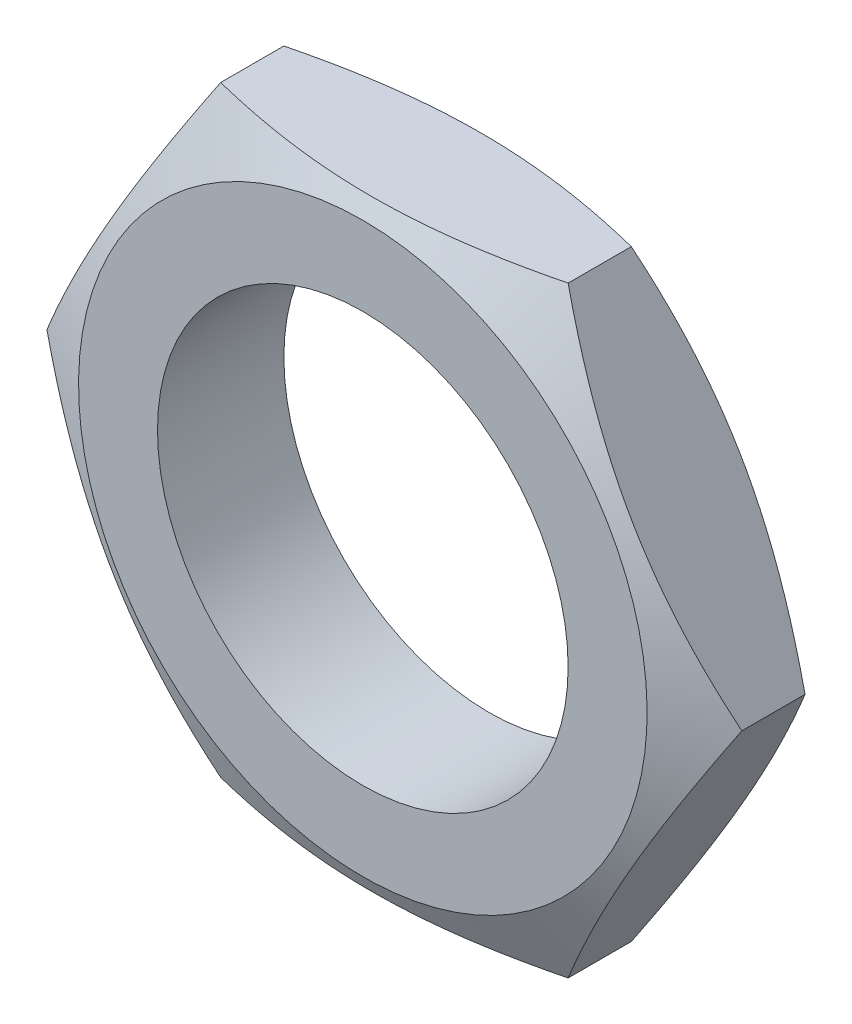
ISO-10303-21;
HEADER;
FILE_DESCRIPTION(('STEP AP214'),'2;1');
FILE_NAME('part.step','',(''),(''),'','','');
FILE_SCHEMA(('AUTOMOTIVE_DESIGN { 1 0 10303 214 1 1 1 1 }'));
ENDSEC;
DATA;
#1=APPLICATION_CONTEXT('core data for automotive mechanical design processes');
#2=APPLICATION_PROTOCOL_DEFINITION('international standard','automotive_design',2000,#1);
#3=PRODUCT_CONTEXT('',#1,'mechanical');
#4=PRODUCT('Part','Part','',(#3));
#5=PRODUCT_RELATED_PRODUCT_CATEGORY('part','',(#4));
#6=PRODUCT_DEFINITION_FORMATION('','',#4);
#7=PRODUCT_DEFINITION_CONTEXT('part definition',#1,'design');
#8=PRODUCT_DEFINITION('design','',#6,#7);
#9=PRODUCT_DEFINITION_SHAPE('','',#8);
#10=(LENGTH_UNIT() NAMED_UNIT(*) SI_UNIT(.MILLI.,.METRE.));
#11=(NAMED_UNIT(*) PLANE_ANGLE_UNIT() SI_UNIT($,.RADIAN.));
#12=(NAMED_UNIT(*) SI_UNIT($,.STERADIAN.) SOLID_ANGLE_UNIT());
#13=UNCERTAINTY_MEASURE_WITH_UNIT(LENGTH_MEASURE(1.E-05),#10,'distance_accuracy_value','');
#14=(GEOMETRIC_REPRESENTATION_CONTEXT(3) GLOBAL_UNCERTAINTY_ASSIGNED_CONTEXT((#13)) GLOBAL_UNIT_ASSIGNED_CONTEXT((#10,
#11,#12)) REPRESENTATION_CONTEXT('',''));
#15=CARTESIAN_POINT('',(0.,0.,0.));
#16=DIRECTION('',(0.,0.,1.));
#17=DIRECTION('',(1.,0.,0.));
#18=AXIS2_PLACEMENT_3D('',#15,#16,#17);
#19=CARTESIAN_POINT('',(5.5,0.,0.));
#20=DIRECTION('',(0.866025403784329,-0.50000000000019,0.));
#21=DIRECTION('',(0.50000000000019,0.866025403784329,0.));
#22=AXIS2_PLACEMENT_3D('',#19,#20,#21);
#23=PLANE('',#22);
#24=CARTESIAN_POINT('',(2.74999998059165,-4.76313975442826,1.49999998955182));
#25=CARTESIAN_POINT('',(2.82750720895632,-4.62889329694687,1.53875074037462));
#26=CARTESIAN_POINT('',(2.90531639391744,-4.49412383529876,1.57520168182588));
#27=CARTESIAN_POINT('',(3.06155449277679,-4.22351150999653,1.64273635788375));
#28=CARTESIAN_POINT('',(3.13998370419947,-4.08766813101495,1.67381732871496));
#29=CARTESIAN_POINT('',(3.29751454712741,-3.81481670730475,1.72984451622244));
#30=CARTESIAN_POINT('',(3.37661700193326,-3.67780723657767,1.75478158665256));
#31=CARTESIAN_POINT('',(3.53528348723896,-3.40298882256994,1.79769273905488));
#32=CARTESIAN_POINT('',(3.61484743578261,-3.26518002124162,1.81566802112473));
#33=CARTESIAN_POINT('',(3.77250869375858,-2.99210271204215,1.84370689634938));
#34=CARTESIAN_POINT('',(3.85059836169878,-2.85684743962362,1.85394060943592));
#35=CARTESIAN_POINT('',(4.00694020917695,-2.58605541644237,1.86677848579471));
#36=CARTESIAN_POINT('',(4.08519239654035,-2.45051865212563,1.86938227273784));
#37=CARTESIAN_POINT('',(4.24158076658097,-2.17964604950253,1.86685932607153));
#38=CARTESIAN_POINT('',(4.31971698340526,-2.04431015205171,1.8617409185904));
#39=CARTESIAN_POINT('',(4.47576670243946,-1.77402411017777,1.84398620167749));
#40=CARTESIAN_POINT('',(4.55368022306874,-1.63907393385136,1.83135053321334));
#41=CARTESIAN_POINT('',(4.70423744205068,-1.3783011811285,1.80003821329454));
#42=CARTESIAN_POINT('',(4.77690386486142,-1.25243924481608,1.78179235445715));
#43=CARTESIAN_POINT('',(4.92182855252511,-1.00142232251164,1.73962093699504));
#44=CARTESIAN_POINT('',(4.99408677303879,-0.876267413317495,1.71569477306956));
#45=CARTESIAN_POINT('',(5.13893428940125,-0.625384155627685,1.66246300904158));
#46=CARTESIAN_POINT('',(5.21151829478282,-0.499664970490019,1.63310040795472));
#47=CARTESIAN_POINT('',(5.3561537935932,-0.249148937972488,1.56981511919453));
#48=CARTESIAN_POINT('',(5.42820551936946,-0.12435168815506,1.53589456249241));
#49=CARTESIAN_POINT('',(5.49999991704114,-1.43688962935958E-07,1.50000004073438));
#50=B_SPLINE_CURVE_WITH_KNOTS('',3,(#24,#25,#26,#27,#28,#29,#30,#31,#32,#33,#34,#35,#36,#37,#38,
#39,#40,#41,#42,#43,#44,#45,#46,#47,#48,#49),.UNSPECIFIED.,.F.,.F.,(4,2,2,2,2,2,2,2,2,2,2,2,4),
(0.,0.479378142592037,0.959002277620051,1.43933615856273,1.91958720096182,2.38895095487023,
2.85833785871055,3.32721902760548,3.79606022255459,4.23536075408386,4.67470811908086,
5.11895373860353,5.56299237892725),.UNSPECIFIED.);
#51=CARTESIAN_POINT('',(2.74999997898633,-4.763139720814,1.50000000450855));
#52=VERTEX_POINT('',#51);
#53=CARTESIAN_POINT('',(5.49999993221398,-2.35344048637145E-08,1.50000003314796));
#54=VERTEX_POINT('',#53);
#55=EDGE_CURVE('E187',#52,#54,#50,.T.);
#56=ORIENTED_EDGE('',*,*,#55,.F.);
#57=DIRECTION('',(0.,0.,-1.));
#58=VECTOR('',#57,1.);
#59=CARTESIAN_POINT('',(2.750000041603,-4.763139720814,0.));
#60=LINE('',#59,#58);
#61=CARTESIAN_POINT('',(2.75000002365616,-4.76313971586859,0.500000004583533));
#62=VERTEX_POINT('',#61);
#63=EDGE_CURVE('E106',#62,#52,#60,.F.);
#64=ORIENTED_EDGE('',*,*,#63,.F.);
#65=CARTESIAN_POINT('',(5.49999993094799,-3.30845369369087E-08,0.500000014649597));
#66=CARTESIAN_POINT('',(5.42249273002794,-0.134246498468859,0.461249247560524));
#67=CARTESIAN_POINT('',(5.344683557131,-0.269015961969993,0.424798300413727));
#68=CARTESIAN_POINT('',(5.18844546893168,-0.539628285472494,0.357263622273518));
#69=CARTESIAN_POINT('',(5.11001625609849,-0.675471660797522,0.326182655054674));
#70=CARTESIAN_POINT('',(4.95248541414733,-0.948323078343564,0.270155472205021));
#71=CARTESIAN_POINT('',(4.87338296173508,-1.08533254656352,0.245218402806533));
#72=CARTESIAN_POINT('',(4.71471648023915,-1.36015095517064,0.202307252934864));
#73=CARTESIAN_POINT('',(4.63515253311164,-1.49795975360592,0.184331972366961));
#74=CARTESIAN_POINT('',(4.47749127831852,-1.77103705697854,0.156293099696337));
#75=CARTESIAN_POINT('',(4.39940161213869,-1.90629232646164,0.146059387663566));
#76=CARTESIAN_POINT('',(4.24305976815914,-2.17708434366626,0.133221513147316));
#77=CARTESIAN_POINT('',(4.16480758253403,-2.31262110494174,0.130617726991038));
#78=CARTESIAN_POINT('',(4.00841921595162,-2.58349370155279,0.133140674867172));
#79=CARTESIAN_POINT('',(3.93028300084722,-2.71882959603281,0.138259082776479));
#80=CARTESIAN_POINT('',(3.77423328524083,-2.98911563197557,0.156013800200948));
#81=CARTESIAN_POINT('',(3.69631976631948,-3.12406580534156,0.168649468749318));
#82=CARTESIAN_POINT('',(3.54576254337759,-3.38483856492177,0.199961790023261));
#83=CARTESIAN_POINT('',(3.47309611493224,-3.51070051099414,0.218207650769129));
#84=CARTESIAN_POINT('',(3.32817141608381,-3.76171745267151,0.260379072865122));
#85=CARTESIAN_POINT('',(3.25591319001994,-3.88687237147872,0.284305239515238));
#86=CARTESIAN_POINT('',(3.11106566246679,-4.13775564855126,0.3375370097382));
#87=CARTESIAN_POINT('',(3.03848165144636,-4.26347484345576,0.366899614310797));
#88=CARTESIAN_POINT('',(2.89384614143332,-4.51399089537691,0.430184910602372));
#89=CARTESIAN_POINT('',(2.82179441009331,-4.63878815483107,0.464105471350446));
#90=CARTESIAN_POINT('',(2.75000000689699,-4.76313970886606,0.49999999736156));
#91=B_SPLINE_CURVE_WITH_KNOTS('',3,(#65,#66,#67,#68,#69,#70,#71,#72,#73,#74,#75,#76,#77,#78,#79,
#80,#81,#82,#83,#84,#85,#86,#87,#88,#89,#90),.UNSPECIFIED.,.F.,.F.,(4,2,2,2,2,2,2,2,2,2,2,2,4),
(0.,0.479378133540439,0.959002259014858,1.43933612961816,1.91958716188759,2.38895090537266,
2.85833779867252,3.32721895733129,3.79606014209499,4.23536070785375,4.67470810701921,
5.11895376176314,5.56299243734623),.UNSPECIFIED.);
#92=CARTESIAN_POINT('',(5.49999977310214,2.95322379273276E-09,0.499999887425601));
#93=VERTEX_POINT('',#92);
#94=EDGE_CURVE('E181',#93,#62,#91,.T.);
#95=ORIENTED_EDGE('',*,*,#94,.F.);
#96=DIRECTION('',(0.,0.,1.));
#97=VECTOR('',#96,1.);
#98=CARTESIAN_POINT('',(5.49999994580216,9.38754195906055E-08,0.));
#99=LINE('',#98,#97);
#100=EDGE_CURVE('E90',#54,#93,#99,.F.);
#101=ORIENTED_EDGE('',*,*,#100,.F.);
#102=EDGE_LOOP('',(#56,#64,#95,#101));
#103=FACE_BOUND('',#102,.T.);
#104=ADVANCED_FACE('F17',(#103),#23,.T.);
#105=CARTESIAN_POINT('',(2.75,4.763139720814,0.));
#106=DIRECTION('',(0.866025403784329,0.50000000000019,0.));
#107=DIRECTION('',(-0.50000000000019,0.866025403784329,0.));
#108=AXIS2_PLACEMENT_3D('',#105,#106,#107);
#109=PLANE('',#108);
#110=CARTESIAN_POINT('',(5.49999990740493,2.84497346673083E-08,1.49999997180047));
#111=CARTESIAN_POINT('',(5.42249272039935,0.134246498834246,1.53875074815011));
#112=CARTESIAN_POINT('',(5.34468355334028,0.269015964165199,1.57520169901391));
#113=CARTESIAN_POINT('',(5.18844546973658,0.539628288455109,1.64273637969795));
#114=CARTESIAN_POINT('',(5.11001625565781,0.675471662735756,1.67381734574399));
#115=CARTESIAN_POINT('',(4.95248541318418,0.948323078839099,1.7298445275809));
#116=CARTESIAN_POINT('',(4.87338296149828,1.08533254666116,1.75478159714575));
#117=CARTESIAN_POINT('',(4.71471648092729,1.36015095429518,1.79769274705994));
#118=CARTESIAN_POINT('',(4.63515253399834,1.49795975215547,1.81566802750249));
#119=CARTESIAN_POINT('',(4.47749127978081,1.77103705436631,1.84370690007331));
#120=CARTESIAN_POINT('',(4.39940161397504,1.90629232326116,1.85394061213215));
#121=CARTESIAN_POINT('',(4.2430597707178,2.17708433925837,1.86677848674587));
#122=CARTESIAN_POINT('',(4.16480758544095,2.31262109991465,1.86938227297453));
#123=CARTESIAN_POINT('',(4.00841921954027,2.58349369533323,1.86685932531982));
#124=CARTESIAN_POINT('',(3.93028300476934,2.71882958923995,1.86174091755741));
#125=CARTESIAN_POINT('',(3.77423328981852,2.98911562405034,1.84398620048343));
#126=CARTESIAN_POINT('',(3.69631977121929,3.12406579685725,1.83135053213832));
#127=CARTESIAN_POINT('',(3.54576255164375,3.38483855060596,1.80003821187679));
#128=CARTESIAN_POINT('',(3.47309612623062,3.51070049142666,1.7817923521709));
#129=CARTESIAN_POINT('',(3.32817143341531,3.76171742265456,1.73962093259767));
#130=CARTESIAN_POINT('',(3.25591321035231,3.88687233626405,1.71569476743109));
#131=CARTESIAN_POINT('',(3.11106568880828,4.13775560292844,1.6624630005627));
#132=CARTESIAN_POINT('',(3.03848168079549,4.26347479262355,1.6331003978665));
#133=CARTESIAN_POINT('',(2.89384617673973,4.51399083422642,1.56981510561706));
#134=CARTESIAN_POINT('',(2.82179444834946,4.63878808857151,1.53589454703375));
#135=CARTESIAN_POINT('',(2.7500000480821,4.76313963753335,1.50000002329619));
#136=B_SPLINE_CURVE_WITH_KNOTS('',3,(#110,#111,#112,#113,#114,#115,#116,#117,#118,#119,#120,
#121,#122,#123,#124,#125,#126,#127,#128,#129,#130,#131,#132,#133,#134,#135),.UNSPECIFIED.,.F.,
.F.,(4,2,2,2,2,2,2,2,2,2,2,2,4),(0.,0.479378132177732,0.959002256032765,1.43933612468066,
1.91958715510268,2.38895089652017,2.85833778769214,3.32721894435149,3.79606012713717,
4.23536067447197,4.6747080551579,5.11895369110536,5.56299234798144),.UNSPECIFIED.);
#137=CARTESIAN_POINT('',(2.7500000298846,4.7631396790307,1.50000000987668));
#138=VERTEX_POINT('',#137);
#139=EDGE_CURVE('E192',#54,#138,#136,.T.);
#140=ORIENTED_EDGE('',*,*,#139,.F.);
#141=ORIENTED_EDGE('',*,*,#100,.T.);
#142=CARTESIAN_POINT('',(2.75000002969539,4.76313964696146,0.49999998870297));
#143=CARTESIAN_POINT('',(2.82750726240892,4.62889319631304,0.461249235116208));
#144=CARTESIAN_POINT('',(2.90531644836219,4.49412373884122,0.424798293649872));
#145=CARTESIAN_POINT('',(3.06155454620447,4.22351141961863,0.357263619964566));
#146=CARTESIAN_POINT('',(3.13998375561624,4.08766804253951,0.326182651520666));
#147=CARTESIAN_POINT('',(3.29751459522609,3.81481662341751,0.270155468090289));
#148=CARTESIAN_POINT('',(3.37661704872552,3.67780715537785,0.245218399344767));
#149=CARTESIAN_POINT('',(3.53528353117538,3.40298874662705,0.202307250341607));
#150=CARTESIAN_POINT('',(3.6148474781697,3.26517994786817,0.184331969987125));
#151=CARTESIAN_POINT('',(3.77250873311986,2.99210264382819,0.156293097896189));
#152=CARTESIAN_POINT('',(3.85059839958329,2.85684737399695,0.146059386235723));
#153=CARTESIAN_POINT('',(4.00694024405337,2.58605535604742,0.133221512481052));
#154=CARTESIAN_POINT('',(4.08519242988544,2.45051859437514,0.130617726715453));
#155=CARTESIAN_POINT('',(4.24158079686456,2.17964599704893,0.133140675421906));
#156=CARTESIAN_POINT('',(4.31971701215871,2.0443101022505,0.138259083767985));
#157=CARTESIAN_POINT('',(4.47576672812235,1.77402406569647,0.156013802080627));
#158=CARTESIAN_POINT('',(4.55368024721121,1.63907389203758,0.168649471079848));
#159=CARTESIAN_POINT('',(4.7042374670579,1.37830113781653,0.199961792518025));
#160=CARTESIAN_POINT('',(4.77690389225638,1.25243919736857,0.218207652686952));
#161=CARTESIAN_POINT('',(4.92182858465376,1.00142226686524,0.260379073114698));
#162=CARTESIAN_POINT('',(4.99408680751341,0.876267353607718,0.28430523867401));
#163=CARTESIAN_POINT('',(5.13893432858825,0.625384087755782,0.337537006237026));
#164=CARTESIAN_POINT('',(5.2115183363356,0.499664898520474,0.366899609230059));
#165=CARTESIAN_POINT('',(5.35615383984345,0.249148857866715,0.430184901988391));
#166=CARTESIAN_POINT('',(5.42820556795139,0.124351604010701,0.464105460782557));
#167=CARTESIAN_POINT('',(5.49999996793887,5.55335039963118E-08,0.499999984695439));
#168=B_SPLINE_CURVE_WITH_KNOTS('',3,(#142,#143,#144,#145,#146,#147,#148,#149,#150,#151,#152,
#153,#154,#155,#156,#157,#158,#159,#160,#161,#162,#163,#164,#165,#166,#167),.UNSPECIFIED.,.F.,
.F.,(4,2,2,2,2,2,2,2,2,2,2,2,4),(0.,0.479378133482542,0.959002259257795,1.43933613061397,
1.91958716348448,2.3889509082076,2.85833780283198,3.32721896264275,3.79606014852415,
4.2353606947543,4.67470807443204,5.11895370899716,5.56299236437162),.UNSPECIFIED.);
#169=CARTESIAN_POINT('',(2.75000000876441,4.763139720814,0.500000002916928));
#170=VERTEX_POINT('',#169);
#171=EDGE_CURVE('E21',#170,#93,#168,.T.);
#172=ORIENTED_EDGE('',*,*,#171,.F.);
#173=DIRECTION('',(0.,0.,1.));
#174=VECTOR('',#173,1.);
#175=CARTESIAN_POINT('',(2.750000011522,4.763139720814,0.));
#176=LINE('',#175,#174);
#177=EDGE_CURVE('E79',#138,#170,#176,.F.);
#178=ORIENTED_EDGE('',*,*,#177,.F.);
#179=EDGE_LOOP('',(#140,#141,#172,#178));
#180=FACE_BOUND('',#179,.T.);
#181=ADVANCED_FACE('F103',(#180),#109,.T.);
#182=CARTESIAN_POINT('',(-2.75,4.763139720814,0.));
#183=DIRECTION('',(0.,1.,0.));
#184=DIRECTION('',(0.,0.,1.));
#185=AXIS2_PLACEMENT_3D('',#182,#183,#184);
#186=PLANE('',#185);
#187=CARTESIAN_POINT('',(2.75000004666141,4.763139720814,1.49999998758978));
#188=CARTESIAN_POINT('',(2.52342892769615,4.76313972175959,1.55665457757312));
#189=CARTESIAN_POINT('',(2.2954867106483,4.76313972128717,1.60838808374892));
#190=CARTESIAN_POINT('',(1.83681715398184,4.76313972034008,1.69964852347283));
#191=CARTESIAN_POINT('',(1.6060859734503,4.76313971986542,1.73915598482013));
#192=CARTESIAN_POINT('',(1.14659683709032,4.76313972174588,1.80283925060461));
#193=CARTESIAN_POINT('',(0.917875671249006,4.76313972405134,1.82727276192893));
#194=CARTESIAN_POINT('',(0.459435732803817,4.76313971757916,1.86006200573323));
#195=CARTESIAN_POINT('',(0.229717866401829,4.76313970881009,1.86843013255323));
#196=CARTESIAN_POINT('',(-0.229717865930029,4.76313970881009,1.86843013255337));
#197=CARTESIAN_POINT('',(-0.4594357318599,4.76313971757916,1.86006200576789));
#198=CARTESIAN_POINT('',(-0.917875669366806,4.76313972405134,1.82727276209647));
#199=CARTESIAN_POINT('',(-1.14659683474196,4.76313972174588,1.80283925087062));
#200=CARTESIAN_POINT('',(-1.60608597016373,4.76313971986542,1.73915598533625));
#201=CARTESIAN_POINT('',(-1.83681715022349,4.76313972034008,1.69964852414204));
#202=CARTESIAN_POINT('',(-2.29548670596061,4.76313972128717,1.60838808476027));
#203=CARTESIAN_POINT('',(-2.52342892255087,4.76313972175959,1.55665457877335));
#204=CARTESIAN_POINT('',(-2.75000004106403,4.763139720814,1.49999998898913));
#205=B_SPLINE_CURVE_WITH_KNOTS('',3,(#187,#188,#189,#190,#191,#192,#193,#194,#195,#196,#197,
#198,#199,#200,#201,#202,#203,#204),.UNSPECIFIED.,.F.,.F.,(4,2,2,2,2,2,2,2,4),(0.,
0.700792750131162,1.40269596315295,2.09224026422371,2.78125237221931,3.4702644787998,
4.15980877845142,4.86171199000222,5.56250473867125),.UNSPECIFIED.);
#206=CARTESIAN_POINT('',(-2.75000001962436,4.7631397223851,1.49999999366874));
#207=VERTEX_POINT('',#206);
#208=EDGE_CURVE('E84',#138,#207,#205,.T.);
#209=ORIENTED_EDGE('',*,*,#208,.F.);
#210=ORIENTED_EDGE('',*,*,#177,.T.);
#211=CARTESIAN_POINT('',(-2.75000006030562,4.76313966130576,0.500000056566638));
#212=CARTESIAN_POINT('',(-2.59498560953767,4.76313969943746,0.461249280789425));
#213=CARTESIAN_POINT('',(-2.43936724218275,4.76313971508455,0.424798328908528));
#214=CARTESIAN_POINT('',(-2.12689104681995,4.76313972654639,0.357263644814905));
#215=CARTESIAN_POINT('',(-1.97003262376324,4.76313972235095,0.32618267637664));
#216=CARTESIAN_POINT('',(-1.65497093856631,4.76313971927478,0.27015549018335));
#217=CARTESIAN_POINT('',(-1.49676602982806,4.76313972040191,0.245218418658231));
#218=CARTESIAN_POINT('',(-1.17943306064616,4.76313972122601,0.202307264872255));
#219=CARTESIAN_POINT('',(-1.02030516411441,4.76313972092322,0.184331982517688));
#220=CARTESIAN_POINT('',(-0.704982649718567,4.76313972070725,0.156293106428864));
#221=CARTESIAN_POINT('',(-0.548803314839606,4.7631397207854,0.146059392751045));
#222=CARTESIAN_POINT('',(-0.236119621898184,4.7631397208426,0.133221515162552));
#223=CARTESIAN_POINT('',(-0.0796152481849835,4.76313972082166,0.130617727578367));
#224=CARTESIAN_POINT('',(0.233161490009973,4.76313972080635,0.133140672852487));
#225=CARTESIAN_POINT('',(0.389433922785794,4.76313972081195,0.138259079587925));
#226=CARTESIAN_POINT('',(0.701533359168725,4.76313972081605,0.156013794961259));
#227=CARTESIAN_POINT('',(0.857360399614524,4.76313972081453,0.168649462632588));
#228=CARTESIAN_POINT('',(1.15847485492737,4.7631397208135,0.199961782959037));
#229=CARTESIAN_POINT('',(1.3038077186234,4.76313972081387,0.218207643801741));
#230=CARTESIAN_POINT('',(1.59365712986701,4.76313972081413,0.260379066674078));
#231=CARTESIAN_POINT('',(1.73817358873615,4.76313972081404,0.284305234003716));
#232=CARTESIAN_POINT('',(2.02786865746347,4.76313972081396,0.337537006126594));
#233=CARTESIAN_POINT('',(2.17303668638206,4.76313972081398,0.366899611930478));
#234=CARTESIAN_POINT('',(2.46230772006374,4.76313972081402,0.430184911120166));
#235=CARTESIAN_POINT('',(2.60641118952173,4.76313972081404,0.464105473534768));
#236=CARTESIAN_POINT('',(2.75000000264251,4.763139720814,0.500000001386451));
#237=B_SPLINE_CURVE_WITH_KNOTS('',3,(#211,#212,#213,#214,#215,#216,#217,#218,#219,#220,#221,
#222,#223,#224,#225,#226,#227,#228,#229,#230,#231,#232,#233,#234,#235,#236),.UNSPECIFIED.,.F.,
.F.,(4,2,2,2,2,2,2,2,2,2,2,2,4),(0.,0.479378142206688,0.959002276182124,1.43933615521583,
1.91958719598817,2.38895094704497,2.85833784787258,3.32721901408206,3.79606020641162,
4.23536079244227,4.67470821187794,5.11895388756647,5.56299258407495),.UNSPECIFIED.);
#238=CARTESIAN_POINT('',(-2.75000003567064,4.76313965902863,0.499999982889637));
#239=VERTEX_POINT('',#238);
#240=EDGE_CURVE('E83',#239,#170,#237,.T.);
#241=ORIENTED_EDGE('',*,*,#240,.F.);
#242=DIRECTION('',(0.,0.,1.));
#243=VECTOR('',#242,1.);
#244=CARTESIAN_POINT('',(-2.7499999981847,4.7631397239562,0.));
#245=LINE('',#244,#243);
#246=EDGE_CURVE('E89',#207,#239,#245,.F.);
#247=ORIENTED_EDGE('',*,*,#246,.F.);
#248=EDGE_LOOP('',(#209,#210,#241,#247));
#249=FACE_BOUND('',#248,.T.);
#250=ADVANCED_FACE('F81',(#249),#186,.T.);
#251=CARTESIAN_POINT('',(-5.5,0.,0.));
#252=DIRECTION('',(-0.866025403784329,0.50000000000019,0.));
#253=DIRECTION('',(-0.50000000000019,-0.866025403784329,0.));
#254=AXIS2_PLACEMENT_3D('',#251,#252,#253);
#255=PLANE('',#254);
#256=CARTESIAN_POINT('',(-2.75000004418846,4.76313964715362,1.50000002171291));
#257=CARTESIAN_POINT('',(-2.82750727049458,4.6288931913934,1.53875076995645));
#258=CARTESIAN_POINT('',(-2.9053164538184,4.49412373182437,1.57520170916632));
#259=CARTESIAN_POINT('',(-3.06155454975652,4.22351141102747,1.64273638106405));
#260=CARTESIAN_POINT('',(-3.13998375989546,4.08766803447233,1.67381734997665));
#261=CARTESIAN_POINT('',(-3.2975146000948,3.81481661563697,1.72984453360668));
#262=CARTESIAN_POINT('',(-3.37661705345543,3.67780714735857,1.75478160207976));
#263=CARTESIAN_POINT('',(-3.53528353585641,3.40298873834212,1.79769275071127));
#264=CARTESIAN_POINT('',(-3.61484748294054,3.26517993955639,1.81566803096738));
#265=CARTESIAN_POINT('',(-3.77250873804401,2.99210263534269,1.84370690280272));
#266=CARTESIAN_POINT('',(-3.85059840457263,2.8568473653653,1.85394061430352));
#267=CARTESIAN_POINT('',(-4.00694024919178,2.58605534713327,1.8667784877337));
#268=CARTESIAN_POINT('',(-4.08519243510773,2.4505185853246,1.8693822733339));
#269=CARTESIAN_POINT('',(-4.24158080223447,2.17964598774923,1.86685932427932));
#270=CARTESIAN_POINT('',(-4.31971701759236,2.04431009283802,1.86174091575163));
#271=CARTESIAN_POINT('',(-4.47576673367809,1.77402405607078,1.84398619707224));
#272=CARTESIAN_POINT('',(-4.5536802528253,1.63907388231145,1.83135052788811));
#273=CARTESIAN_POINT('',(-4.70423747148736,1.37830113014269,1.80003820636285));
#274=CARTESIAN_POINT('',(-4.77690389544894,1.25243919183695,1.78179234640169));
#275=CARTESIAN_POINT('',(-4.92182858538897,1.00142226558976,1.73962092658661));
#276=CARTESIAN_POINT('',(-4.99408680702816,0.876267354446174,1.71569476143201));
#277=CARTESIAN_POINT('',(-5.13893432563476,0.6253840928694,1.66246299486203));
#278=CARTESIAN_POINT('',(-5.2115183321347,0.499664905794652,1.63310039246135));
#279=CARTESIAN_POINT('',(-5.35615383316323,0.249148869435188,1.56981510103168));
#280=CARTESIAN_POINT('',(-5.42820556003926,0.124351617712894,1.53589454297392));
#281=CARTESIAN_POINT('',(-5.49999995880375,7.1353996487851E-08,1.50000001985308));
#282=B_SPLINE_CURVE_WITH_KNOTS('',3,(#256,#257,#258,#259,#260,#261,#262,#263,#264,#265,#266,
#267,#268,#269,#270,#271,#272,#273,#274,#275,#276,#277,#278,#279,#280,#281),.UNSPECIFIED.,.F.,
.F.,(4,2,2,2,2,2,2,2,2,2,2,2,4),(0.,0.479378133408322,0.95900225925081,1.43933613085113,
1.91958716390592,2.38895090906793,2.85833780416533,3.32721896438162,3.79606015065503,
4.23536068945129,4.67470806171137,5.11895368859199,5.56299233626975),.UNSPECIFIED.);
#283=CARTESIAN_POINT('',(-5.49999997758494,3.25289737724167E-08,1.50000001046249));
#284=VERTEX_POINT('',#283);
#285=EDGE_CURVE('E211',#207,#284,#282,.T.);
#286=ORIENTED_EDGE('',*,*,#285,.F.);
#287=ORIENTED_EDGE('',*,*,#246,.T.);
#288=CARTESIAN_POINT('',(-5.49999991765709,3.32000124733675E-08,0.500000020723354));
#289=CARTESIAN_POINT('',(-5.4224927237944,0.134246501037712,0.461249249013304));
#290=CARTESIAN_POINT('',(-5.34468355388163,0.269015965392764,0.424798300041211));
#291=CARTESIAN_POINT('',(-5.18844546808052,0.539628289153154,0.35726362071514));
#292=CARTESIAN_POINT('',(-5.1100162546597,0.675471663881158,0.326182654135539));
#293=CARTESIAN_POINT('',(-4.95248541252639,0.948323080558642,0.270155471889017));
#294=CARTESIAN_POINT('',(-4.87338296052126,1.08533254850729,0.245218402451294));
#295=CARTESIAN_POINT('',(-4.7147164795744,1.3601509564806,0.202307252643066));
#296=CARTESIAN_POINT('',(-4.63515253258882,1.4979597545535,0.184331972178601));
#297=CARTESIAN_POINT('',(-4.47749127815147,1.77103705722678,0.156293099628433));
#298=CARTESIAN_POINT('',(-4.39940161218389,1.90629232637235,0.146059387614249));
#299=CARTESIAN_POINT('',(-4.24305976861644,2.17708434288521,0.133221513108426));
#300=CARTESIAN_POINT('',(-4.1648075831912,2.31262110380644,0.130617726943505));
#301=CARTESIAN_POINT('',(-4.00841921700203,2.58349369973048,0.133140674758592));
#302=CARTESIAN_POINT('',(-3.93028300209102,2.71882959387771,0.138259082616558));
#303=CARTESIAN_POINT('',(-3.77423328686621,2.98911562916112,0.156013799904103));
#304=CARTESIAN_POINT('',(-3.69631976813306,3.12406580220054,0.168649468367024));
#305=CARTESIAN_POINT('',(-3.54576255080691,3.38483855205361,0.199961788352554));
#306=CARTESIAN_POINT('',(-3.47309612776561,3.51070048876604,0.218207647450375));
#307=CARTESIAN_POINT('',(-3.32817143966366,3.76171741183005,0.260379065447162));
#308=CARTESIAN_POINT('',(-3.25591321894218,3.88687232138393,0.284305229645483));
#309=CARTESIAN_POINT('',(-3.11106570211735,4.13775557987447,0.337536994248681));
#310=CARTESIAN_POINT('',(-3.03848169648157,4.26347476545248,0.366899595641511));
#311=CARTESIAN_POINT('',(-2.89384619714548,4.51399079888062,0.430184885032197));
#312=CARTESIAN_POINT('',(-2.82179447109789,4.63878804916806,0.464105442060206));
#313=CARTESIAN_POINT('',(-2.75000007315659,4.76313959410107,0.499999964146665));
#314=B_SPLINE_CURVE_WITH_KNOTS('',3,(#288,#289,#290,#291,#292,#293,#294,#295,#296,#297,#298,
#299,#300,#301,#302,#303,#304,#305,#306,#307,#308,#309,#310,#311,#312,#313),.UNSPECIFIED.,.F.,
.F.,(4,2,2,2,2,2,2,2,2,2,2,2,4),(0.,0.479378132586811,0.959002256977838,1.43933612633245,
1.9195871574076,2.38895089970258,2.85833779178262,3.32721894928464,3.79606013289994,
4.23536066589973,4.67470803225995,5.11895365345956,5.56299229559182),.UNSPECIFIED.);
#315=CARTESIAN_POINT('',(-5.49999994977155,-3.40806500696347E-08,0.499999935804864));
#316=VERTEX_POINT('',#315);
#317=EDGE_CURVE('E99',#316,#239,#314,.T.);
#318=ORIENTED_EDGE('',*,*,#317,.F.);
#319=DIRECTION('',(0.,0.,1.));
#320=VECTOR('',#319,1.);
#321=CARTESIAN_POINT('',(-5.49999999636613,-6.29604875179712E-09,0.));
#322=LINE('',#321,#320);
#323=EDGE_CURVE('E113',#284,#316,#322,.F.);
#324=ORIENTED_EDGE('',*,*,#323,.F.);
#325=EDGE_LOOP('',(#286,#287,#318,#324));
#326=FACE_BOUND('',#325,.T.);
#327=ADVANCED_FACE('F205',(#326),#255,.T.);
#328=CARTESIAN_POINT('',(-2.75,-4.763139720814,0.));
#329=DIRECTION('',(-0.866025403784329,-0.50000000000019,0.));
#330=DIRECTION('',(0.50000000000019,-0.866025403784329,0.));
#331=AXIS2_PLACEMENT_3D('',#328,#329,#330);
#332=PLANE('',#331);
#333=CARTESIAN_POINT('',(-5.50000001536371,2.66087211979878E-08,1.4999999915731));
#334=CARTESIAN_POINT('',(-5.4224927870784,-0.13424643073521,1.53875074227092));
#335=CARTESIAN_POINT('',(-5.34468360219715,-0.269015892244986,1.57520168359589));
#336=CARTESIAN_POINT('',(-5.18844550349927,-0.539628217267523,1.64273635940088));
#337=CARTESIAN_POINT('',(-5.11001629215821,-0.675471596107737,1.67381733010552));
#338=CARTESIAN_POINT('',(-4.9524854493986,-0.948323019526391,1.72984451736099));
#339=CARTESIAN_POINT('',(-4.87338299467948,-1.08533249010325,1.7547815876659));
#340=CARTESIAN_POINT('',(-4.7147165095498,-1.36015090380609,1.79769273982454));
#341=CARTESIAN_POINT('',(-4.63515256109544,-1.49795970497976,1.81566802177592));
#342=CARTESIAN_POINT('',(-4.47749130330856,-1.77103701385172,1.8437068967758));
#343=CARTESIAN_POINT('',(-4.39940163546814,-1.90629228609743,1.85394060975669));
#344=CARTESIAN_POINT('',(-4.24305978819219,-2.17708430892842,1.86677848592143));
#345=CARTESIAN_POINT('',(-4.16480760093123,-2.31262107306771,1.86938227277617));
#346=CARTESIAN_POINT('',(-4.00841923109611,-2.58349367533488,1.86685932595405));
#347=CARTESIAN_POINT('',(-3.93028301437487,-2.71882957260721,1.86174091840537));
#348=CARTESIAN_POINT('',(-3.77423329554759,-2.98911561412276,1.8439862013802));
#349=CARTESIAN_POINT('',(-3.69631977502218,-3.12406579026927,1.8313505328713));
#350=CARTESIAN_POINT('',(-3.54576255288451,-3.38483854845801,1.80003821218916));
#351=CARTESIAN_POINT('',(-3.47309612682929,-3.51070049039004,1.78179235234623));
#352=CARTESIAN_POINT('',(-3.32817143271598,-3.76171742386553,1.73962093239304));
#353=CARTESIAN_POINT('',(-3.2559132089972,-3.88687233861108,1.71569476698183));
#354=CARTESIAN_POINT('',(-3.11106568619264,-4.13775560745894,1.66246299955213));
#355=CARTESIAN_POINT('',(-3.03848167757487,-4.26347479820187,1.63310039654179));
#356=CARTESIAN_POINT('',(-2.89384617234487,-4.51399084183851,1.56981510360972));
#357=CARTESIAN_POINT('',(-2.82179444338513,-4.63878809716988,1.53589454465964));
#358=CARTESIAN_POINT('',(-2.75000004255243,-4.76313964711103,1.50000002053135));
#359=B_SPLINE_CURVE_WITH_KNOTS('',3,(#333,#334,#335,#336,#337,#338,#339,#340,#341,#342,#343,
#344,#345,#346,#347,#348,#349,#350,#351,#352,#353,#354,#355,#356,#357,#358),.UNSPECIFIED.,.F.,
.F.,(4,2,2,2,2,2,2,2,2,2,2,2,4),(0.,0.479378142039024,0.959002276512772,1.43933615688299,
1.91958719871005,2.38895095200084,2.85833785522294,3.32721902350709,3.79606021784776,
4.23536076905114,4.67470815373653,5.11895379342692,5.56299245387899),.UNSPECIFIED.);
#360=CARTESIAN_POINT('',(-2.75000002311584,-4.7631396839164,1.5000000094533));
#361=VERTEX_POINT('',#360);
#362=EDGE_CURVE('E142',#284,#361,#359,.T.);
#363=ORIENTED_EDGE('',*,*,#362,.F.);
#364=ORIENTED_EDGE('',*,*,#323,.T.);
#365=CARTESIAN_POINT('',(-2.7499999183441,-4.76313974332671,0.500000056623235));
#366=CARTESIAN_POINT('',(-2.82750717670933,-4.62889331008405,0.461249280872455));
#367=CARTESIAN_POINT('',(-2.90531637391019,-4.49412385850476,0.424798329005216));
#368=CARTESIAN_POINT('',(-3.06155448147578,-4.22351154102788,0.3572636449261));
#369=CARTESIAN_POINT('',(-3.1399836893561,-4.08766815979781,0.326182676488687));
#370=CARTESIAN_POINT('',(-3.29751452925971,-3.81481673517857,0.270155490296403));
#371=CARTESIAN_POINT('',(-3.37661698458882,-3.6778072657976,0.245218418771606));
#372=CARTESIAN_POINT('',(-3.53528346986198,-3.40298885349312,0.202307264982788));
#373=CARTESIAN_POINT('',(-3.61484741785027,-3.2651800525216,0.184331982625051));
#374=CARTESIAN_POINT('',(-3.77250867485505,-2.99210274457271,0.156293106522898));
#375=CARTESIAN_POINT('',(-3.85059834237155,-2.85684747304419,0.146059392837257));
#376=CARTESIAN_POINT('',(-4.00694018891098,-2.58605545160322,0.133221515235196));
#377=CARTESIAN_POINT('',(-4.08519237575926,-2.45051868813684,0.130617727645285));
#378=CARTESIAN_POINT('',(-4.24158074486225,-2.17964608710717,0.133140672910285));
#379=CARTESIAN_POINT('',(-4.31971696126396,-2.04431019039948,0.138259079642243));
#380=CARTESIAN_POINT('',(-4.47576667947661,-1.77402414995668,0.156013795011147));
#381=CARTESIAN_POINT('',(-4.5536801997069,-1.63907397431832,0.168649462681466));
#382=CARTESIAN_POINT('',(-4.7042374216671,-1.37830121643489,0.199961781819221));
#383=CARTESIAN_POINT('',(-4.77690384783713,-1.25243927430474,0.218207640988182));
#384=CARTESIAN_POINT('',(-4.92182854217012,-1.00142234044928,0.26037905966609));
#385=CARTESIAN_POINT('',(-4.99408676599388,-0.876267425521706,0.284305224474661));
#386=CARTESIAN_POINT('',(-5.13893428907828,-0.625384156188992,0.337536990795075));
#387=CARTESIAN_POINT('',(-5.21151829787052,-0.499664965143923,0.366899593304294));
#388=CARTESIAN_POINT('',(-5.35615380346961,-0.249148920868082,0.43018488532806));
#389=CARTESIAN_POINT('',(-5.42820553262382,-0.124351665199902,0.46410544387223));
#390=CARTESIAN_POINT('',(-5.49999993364876,-1.14925716456529E-07,0.49999996763548));
#391=B_SPLINE_CURVE_WITH_KNOTS('',3,(#365,#366,#367,#368,#369,#370,#371,#372,#373,#374,#375,
#376,#377,#378,#379,#380,#381,#382,#383,#384,#385,#386,#387,#388,#389,#390),.UNSPECIFIED.,.F.,
.F.,(4,2,2,2,2,2,2,2,2,2,2,2,4),(0.,0.479378142101849,0.959002275973122,1.43933615491552,
1.9195871955961,2.38895094671049,2.85833784759685,3.32721901385984,3.79606020623915,
4.2353607578696,4.67470814287883,5.11895378329449,5.56299244460038),.UNSPECIFIED.);
#392=CARTESIAN_POINT('',(-2.74999992867962,-4.763139720814,0.499999982980826));
#393=VERTEX_POINT('',#392);
#394=EDGE_CURVE('E165',#393,#316,#391,.T.);
#395=ORIENTED_EDGE('',*,*,#394,.F.);
#396=DIRECTION('',(0.,0.,-1.));
#397=VECTOR('',#396,1.);
#398=CARTESIAN_POINT('',(-2.750000003626,-4.763139720814,0.));
#399=LINE('',#398,#397);
#400=EDGE_CURVE('E105',#361,#393,#399,.T.);
#401=ORIENTED_EDGE('',*,*,#400,.F.);
#402=EDGE_LOOP('',(#363,#364,#395,#401));
#403=FACE_BOUND('',#402,.T.);
#404=ADVANCED_FACE('F154',(#403),#332,.T.);
#405=CARTESIAN_POINT('',(2.75,-4.763139720814,0.));
#406=DIRECTION('',(0.,-1.,0.));
#407=DIRECTION('',(0.,0.,-1.));
#408=AXIS2_PLACEMENT_3D('',#405,#406,#407);
#409=PLANE('',#408);
#410=CARTESIAN_POINT('',(-2.75000004015691,-4.763139720814,1.49999998921591));
#411=CARTESIAN_POINT('',(-2.59498558338247,-4.763139720814,1.53875074006416));
#412=CARTESIAN_POINT('',(-2.43936721341482,-4.763139720814,1.57520168154054));
#413=CARTESIAN_POINT('',(-2.12689101560446,-4.763139720814,1.64273635764729));
#414=CARTESIAN_POINT('',(-1.97003259271285,-4.763139720814,1.67381732850226));
#415=CARTESIAN_POINT('',(-1.65497090676533,-4.763139720814,1.72984451605487));
#416=CARTESIAN_POINT('',(-1.49676599710825,-4.763139720814,1.75478158650645));
#417=CARTESIAN_POINT('',(-1.17943302640503,-4.763139720814,1.79769273894889));
#418=CARTESIAN_POINT('',(-1.02030512927132,-4.763139720814,1.81566802103739));
#419=CARTESIAN_POINT('',(-0.704982613258039,-4.763139720814,1.84370689629249));
#420=CARTESIAN_POINT('',(-0.548803277362889,-4.763139720814,1.85394060939236));
#421=CARTESIAN_POINT('',(-0.236119582376613,-4.763139720814,1.86677848577668));
#422=CARTESIAN_POINT('',(-0.0796152076346437,-4.763139720814,1.86938227273203));
#423=CARTESIAN_POINT('',(0.233161532478365,-4.763139720814,1.86685932608846));
#424=CARTESIAN_POINT('',(0.389433966143546,-4.763139720814,1.86174091861784));
#425=CARTESIAN_POINT('',(0.701533404245835,-4.763139720814,1.84398620172404));
#426=CARTESIAN_POINT('',(0.857360445521693,-4.763139720814,1.83135053326847));
#427=CARTESIAN_POINT('',(1.15847489050518,-4.763139720814,1.80003821263714));
#428=CARTESIAN_POINT('',(1.30380774309751,-4.763139720814,1.78179235278165));
#429=CARTESIAN_POINT('',(1.59365713228394,-4.763139720814,1.73962093276243));
#430=CARTESIAN_POINT('',(1.73817358019945,-4.763139720814,1.71569476729772));
#431=CARTESIAN_POINT('',(2.02786862677194,-4.763139720814,1.66246299972352));
#432=CARTESIAN_POINT('',(2.17303664449277,-4.763139720814,1.6331003966215));
#433=CARTESIAN_POINT('',(2.46230765591544,-4.763139720814,1.56981510347601));
#434=CARTESIAN_POINT('',(2.60641111431226,-4.763139720814,1.53589454440425));
#435=CARTESIAN_POINT('',(2.74999991645154,-4.763139720814,1.50000002014225));
#436=B_SPLINE_CURVE_WITH_KNOTS('',3,(#410,#411,#412,#413,#414,#415,#416,#417,#418,#419,#420,
#421,#422,#423,#424,#425,#426,#427,#428,#429,#430,#431,#432,#433,#434,#435),.UNSPECIFIED.,.F.,
.F.,(4,2,2,2,2,2,2,2,2,2,2,2,4),(0.,0.479378142742019,0.959002277920116,1.43933615900744,
1.91958720155126,2.38895095550661,2.85833785939324,3.32721902833673,3.79606022333664,
4.23536077597785,4.67470816210308,5.11895380327437,5.56299246520333),.UNSPECIFIED.);
#437=EDGE_CURVE('E134',#361,#52,#436,.T.);
#438=ORIENTED_EDGE('',*,*,#437,.F.);
#439=ORIENTED_EDGE('',*,*,#400,.T.);
#440=CARTESIAN_POINT('',(2.74999994315175,-4.76313970823559,0.499999995215335));
#441=CARTESIAN_POINT('',(2.59498548986484,-4.76313971629559,0.461249240716438));
#442=CARTESIAN_POINT('',(2.4393671226817,-4.76313971960295,0.424798298669262));
#443=CARTESIAN_POINT('',(2.12689092989988,-4.76313972202567,0.357263624118064));
#444=CARTESIAN_POINT('',(1.97003250925237,-4.76313972113887,0.326182655389116));
#445=CARTESIAN_POINT('',(1.65497082811992,-4.76313972048865,0.270155471314263));
#446=CARTESIAN_POINT('',(1.49676592103481,-4.7631397207269,0.2452184022094));
#447=CARTESIAN_POINT('',(1.17943295547482,-4.76313972090109,0.202307252525769));
#448=CARTESIAN_POINT('',(1.02030506091221,-4.76313972083709,0.184331971850237));
#449=CARTESIAN_POINT('',(0.704982549992456,-4.76313972079144,0.156293099148785));
#450=CARTESIAN_POINT('',(0.548803216617645,-4.76313972080795,0.146059387198095));
#451=CARTESIAN_POINT('',(0.236119526735877,-4.76313972082005,0.133221512904877));
#452=CARTESIAN_POINT('',(0.0796151545781002,-4.76313972081562,0.130617726890906));
#453=CARTESIAN_POINT('',(-0.233161580366996,-4.76313972081238,0.133140675150932));
#454=CARTESIAN_POINT('',(-0.389434011448487,-4.76313972081357,0.138259083298802));
#455=CARTESIAN_POINT('',(-0.701533444370895,-4.76313972081443,0.156013801271711));
#456=CARTESIAN_POINT('',(-0.857360483050555,-4.76313972081411,0.168649470129384));
#457=CARTESIAN_POINT('',(-1.15847491722056,-4.7631397208139,0.199961790673136));
#458=CARTESIAN_POINT('',(-1.30380776162139,-4.76313972081397,0.21820764980935));
#459=CARTESIAN_POINT('',(-1.59365713449909,-4.76313972081403,0.260379067737201));
#460=CARTESIAN_POINT('',(-1.73817357429746,-4.76313972081401,0.284305231829126));
#461=CARTESIAN_POINT('',(-2.02786860455333,-4.76313972081399,0.337536996069813));
#462=CARTESIAN_POINT('',(-2.17303661407659,-4.763139720814,0.366899597201307));
#463=CARTESIAN_POINT('',(-2.46230760924771,-4.763139720814,0.430184885946817));
#464=CARTESIAN_POINT('',(-2.60641105959034,-4.76313972081401,0.464105442590138));
#465=CARTESIAN_POINT('',(-2.74999985373324,-4.763139720814,0.499999964244231));
#466=B_SPLINE_CURVE_WITH_KNOTS('',3,(#440,#441,#442,#443,#444,#445,#446,#447,#448,#449,#450,
#451,#452,#453,#454,#455,#456,#457,#458,#459,#460,#461,#462,#463,#464,#465),.UNSPECIFIED.,.F.,
.F.,(4,2,2,2,2,2,2,2,2,2,2,2,4),(0.,0.479378134994348,0.959002262269213,1.43933613514241,
1.91958716953548,2.38895091573254,2.85833781182775,3.32721897310181,3.79606016044527,
4.23536068845719,4.67470804990244,5.11895366580897,5.56299230256266),.UNSPECIFIED.);
#467=EDGE_CURVE('E100',#62,#393,#466,.T.);
#468=ORIENTED_EDGE('',*,*,#467,.F.);
#469=ORIENTED_EDGE('',*,*,#63,.T.);
#470=EDGE_LOOP('',(#438,#439,#468,#469));
#471=FACE_BOUND('',#470,.T.);
#472=ADVANCED_FACE('F151',(#471),#409,.T.);
#473=CARTESIAN_POINT('',(0.,0.,0.502999999099529));
#474=DIRECTION('',(0.,0.,1.));
#475=DIRECTION('',(1.,0.,0.));
#476=AXIS2_PLACEMENT_3D('',#473,#474,#475);
#477=CONICAL_SURFACE('',#476,5.50599999672841,1.10714871655099);
#478=ORIENTED_EDGE('',*,*,#317,.T.);
#479=ORIENTED_EDGE('',*,*,#240,.T.);
#480=ORIENTED_EDGE('',*,*,#171,.T.);
#481=CARTESIAN_POINT('',(4.50000000034834,0.,-5.96855898038484E-10));
#482=CARTESIAN_POINT('',(4.54166666689109,2.56780701368783E-10,0.0208333327402592));
#483=CARTESIAN_POINT('',(4.58333333343349,4.51827770618724E-10,0.0416666660780681));
#484=CARTESIAN_POINT('',(4.66666666648041,7.18875064441016E-10,0.0833333327347381));
#485=CARTESIAN_POINT('',(4.70833333298492,7.90875289125278E-10,0.104166666053599));
#486=CARTESIAN_POINT('',(4.79166666599463,8.12249313841859E-10,0.145833332689934));
#487=CARTESIAN_POINT('',(4.83333333249983,7.61623113874178E-10,0.166666666007407));
#488=CARTESIAN_POINT('',(4.91666666554536,4.72360955263807E-10,0.208333332666852));
#489=CARTESIAN_POINT('',(4.95833333208568,2.33724996450122E-10,0.229166666008824));
#490=CARTESIAN_POINT('',(5.03547854642161,-1.99013363531378E-10,0.267739273285655));
#491=CARTESIAN_POINT('',(5.07095709421577,-3.94466146950975E-10,0.285478547223376));
#492=CARTESIAN_POINT('',(5.14603960223191,-6.56546363797759E-10,0.323019801340226));
#493=CARTESIAN_POINT('',(5.18564356245281,-7.05551423536382E-10,0.342821781521474));
#494=CARTESIAN_POINT('',(5.26897689542144,-7.08924145593236E-10,0.384488448154714));
#495=CARTESIAN_POINT('',(5.31270626816916,-6.52902006740688E-10,0.406353134606704));
#496=CARTESIAN_POINT('',(5.40429042622762,-4.24156957959045E-10,0.45214521378483));
#497=CARTESIAN_POINT('',(5.45214521153891,-2.40923136284116E-10,0.476072606509855));
#498=CARTESIAN_POINT('',(5.49999999685724,0.,0.49999999922079));
#499=B_SPLINE_CURVE_WITH_KNOTS('',3,(#481,#482,#483,#484,#485,#486,#487,#488,#489,#490,#491,
#492,#493,#494,#495,#496,#497,#498),.UNSPECIFIED.,.F.,.F.,(4,2,2,2,2,2,2,2,4),(0.,
0.139754248266312,0.279508496405519,0.419262744544726,0.559016992811038,0.678015659781661,
0.810851380724857,0.957524155945679,1.11803398554581),.UNSPECIFIED.);
#500=CARTESIAN_POINT('',(4.50000000034834,0.,-6.2527755325878E-10));
#501=VERTEX_POINT('',#500);
#502=EDGE_CURVE('E116',#501,#93,#499,.T.);
#503=ORIENTED_EDGE('',*,*,#502,.F.);
#504=CARTESIAN_POINT('',(0.,0.,-6.53699208479075E-10));
#505=DIRECTION('',(0.,0.,1.));
#506=DIRECTION('',(1.,0.,0.));
#507=AXIS2_PLACEMENT_3D('',#504,#505,#506);
#508=CIRCLE('',#507,4.50000000034834);
#509=CARTESIAN_POINT('',(-4.50000000034834,0.,-5.96856006458701E-10));
#510=VERTEX_POINT('',#509);
#511=EDGE_CURVE('E131',#501,#510,#508,.T.);
#512=ORIENTED_EDGE('',*,*,#511,.T.);
#513=CARTESIAN_POINT('',(-5.49999977079096,-2.91122054247105E-08,0.499999886216074));
#514=CARTESIAN_POINT('',(-5.45833311366067,-2.76786495637263E-08,0.479166557596701));
#515=CARTESIAN_POINT('',(-5.41666645653668,-2.62726628317276E-08,0.45833322896471));
#516=CARTESIAN_POINT('',(-5.33333314234554,-2.35158261024203E-08,0.416666571719677));
#517=CARTESIAN_POINT('',(-5.29166648527839,-2.21649761050415E-08,0.395833243106635));
#518=CARTESIAN_POINT('',(-5.20833317112391,-1.9518411317561E-08,0.354166585883047));
#519=CARTESIAN_POINT('',(-5.16666651403656,-1.82226965274793E-08,0.333333257272502));
#520=CARTESIAN_POINT('',(-5.0833331998214,-1.56864052388812E-08,0.291666600047106));
#521=CARTESIAN_POINT('',(-5.04166654269357,-1.44458287404099E-08,0.270833271432257));
#522=CARTESIAN_POINT('',(-4.95833322844194,-1.20198124395922E-08,0.229166614185066));
#523=CARTESIAN_POINT('',(-4.91666657131812,-1.0834372637251E-08,0.208333285552726));
#524=CARTESIAN_POINT('',(-4.83333325710631,-8.51862836299368E-09,0.166666628311153));
#525=CARTESIAN_POINT('',(-4.79166660001831,-7.38832389102752E-09,0.145833299701919));
#526=CARTESIAN_POINT('',(-4.70833328584283,-5.18285311506192E-09,0.104166642482412));
#527=CARTESIAN_POINT('',(-4.66666662875535,-4.10768681106248E-09,0.083333313872139));
#528=CARTESIAN_POINT('',(-4.58333331456145,-2.01249093738259E-09,0.0416666566421186));
#529=CARTESIAN_POINT('',(-4.54166665745502,-9.92461367727212E-10,0.0208333280223714));
#530=CARTESIAN_POINT('',(-4.50000000034834,0.,-5.96855898038484E-10));
#531=B_SPLINE_CURVE_WITH_KNOTS('',3,(#513,#514,#515,#516,#517,#518,#519,#520,#521,#522,#523,
#524,#525,#526,#527,#528,#529,#530),.UNSPECIFIED.,.F.,.F.,(4,2,2,2,2,2,2,2,4),(0.,
0.139754216680534,0.27950843318312,0.419262649736548,0.559016866404372,0.698771083084905,
0.838525299638334,0.978279516191762,1.11803373280874),.UNSPECIFIED.);
#532=EDGE_CURVE('E40',#316,#510,#531,.T.);
#533=ORIENTED_EDGE('',*,*,#532,.F.);
#534=EDGE_LOOP('',(#478,#479,#480,#503,#512,#533));
#535=FACE_BOUND('',#534,.T.);
#536=ADVANCED_FACE('F95',(#535),#477,.T.);
#537=CARTESIAN_POINT('',(0.,0.,0.502999988214015));
#538=DIRECTION('',(0.,0.,1.));
#539=DIRECTION('',(1.,0.,0.));
#540=AXIS2_PLACEMENT_3D('',#537,#538,#539);
#541=CONICAL_SURFACE('',#540,5.50599997478685,1.10714871652839);
#542=ORIENTED_EDGE('',*,*,#502,.T.);
#543=ORIENTED_EDGE('',*,*,#94,.T.);
#544=ORIENTED_EDGE('',*,*,#467,.T.);
#545=ORIENTED_EDGE('',*,*,#394,.T.);
#546=ORIENTED_EDGE('',*,*,#532,.T.);
#547=CARTESIAN_POINT('',(0.,0.,-5.96856114878919E-10));
#548=DIRECTION('',(0.,0.,1.));
#549=DIRECTION('',(1.,0.,0.));
#550=AXIS2_PLACEMENT_3D('',#547,#548,#549);
#551=CIRCLE('',#550,4.50000000034834);
#552=EDGE_CURVE('E129',#510,#501,#551,.T.);
#553=ORIENTED_EDGE('',*,*,#552,.T.);
#554=EDGE_LOOP('',(#542,#543,#544,#545,#546,#553));
#555=FACE_BOUND('',#554,.T.);
#556=ADVANCED_FACE('F174',(#555),#541,.T.);
#557=CARTESIAN_POINT('',(0.,0.,1.4969999942025));
#558=DIRECTION('',(0.,0.,-1.));
#559=DIRECTION('',(0.,1.,0.));
#560=AXIS2_PLACEMENT_3D('',#557,#558,#559);
#561=CONICAL_SURFACE('',#560,5.50600001008661,1.1071487165736);
#562=CARTESIAN_POINT('',(0.,0.,2.00000000063483));
#563=DIRECTION('',(0.,0.,-1.));
#564=DIRECTION('',(0.,1.,0.));
#565=AXIS2_PLACEMENT_3D('',#562,#563,#564);
#566=CIRCLE('',#565,4.50000000029149);
#567=CARTESIAN_POINT('',(0.,4.50000000029149,2.00000000063483));
#568=VERTEX_POINT('',#567);
#569=EDGE_CURVE('E126',#568,#568,#566,.F.);
#570=ORIENTED_EDGE('',*,*,#569,.F.);
#571=EDGE_LOOP('',(#570));
#572=FACE_BOUND('',#571,.T.);
#573=ORIENTED_EDGE('',*,*,#362,.T.);
#574=ORIENTED_EDGE('',*,*,#437,.T.);
#575=ORIENTED_EDGE('',*,*,#55,.T.);
#576=ORIENTED_EDGE('',*,*,#139,.T.);
#577=ORIENTED_EDGE('',*,*,#208,.T.);
#578=ORIENTED_EDGE('',*,*,#285,.T.);
#579=EDGE_LOOP('',(#573,#574,#575,#576,#577,#578));
#580=FACE_BOUND('',#579,.T.);
#581=ADVANCED_FACE('F148',(#572,#580),#561,.T.);
#582=CARTESIAN_POINT('',(0.,0.,0.));
#583=DIRECTION('',(0.,0.,1.));
#584=DIRECTION('',(1.,0.,0.));
#585=AXIS2_PLACEMENT_3D('',#582,#583,#584);
#586=PLANE('',#585);
#587=CARTESIAN_POINT('',(0.,0.,0.));
#588=DIRECTION('',(0.,0.,1.));
#589=DIRECTION('',(1.,0.,0.));
#590=AXIS2_PLACEMENT_3D('',#587,#588,#589);
#591=CIRCLE('',#590,3.25);
#592=CARTESIAN_POINT('',(3.25,0.,0.));
#593=VERTEX_POINT('',#592);
#594=EDGE_CURVE('E31',#593,#593,#591,.T.);
#595=ORIENTED_EDGE('',*,*,#594,.T.);
#596=EDGE_LOOP('',(#595));
#597=FACE_BOUND('',#596,.T.);
#598=ORIENTED_EDGE('',*,*,#511,.F.);
#599=ORIENTED_EDGE('',*,*,#552,.F.);
#600=EDGE_LOOP('',(#598,#599));
#601=FACE_BOUND('',#600,.T.);
#602=ADVANCED_FACE('F235',(#597,#601),#586,.F.);
#603=CARTESIAN_POINT('',(0.,0.,2.));
#604=DIRECTION('',(0.,0.,1.));
#605=DIRECTION('',(1.,0.,0.));
#606=AXIS2_PLACEMENT_3D('',#603,#604,#605);
#607=PLANE('',#606);
#608=CARTESIAN_POINT('',(0.,0.,2.));
#609=DIRECTION('',(0.,0.,1.));
#610=DIRECTION('',(1.,0.,0.));
#611=AXIS2_PLACEMENT_3D('',#608,#609,#610);
#612=CIRCLE('',#611,3.25);
#613=CARTESIAN_POINT('',(3.25,0.,2.));
#614=VERTEX_POINT('',#613);
#615=EDGE_CURVE('E11',#614,#614,#612,.F.);
#616=ORIENTED_EDGE('',*,*,#615,.T.);
#617=EDGE_LOOP('',(#616));
#618=FACE_BOUND('',#617,.T.);
#619=ORIENTED_EDGE('',*,*,#569,.T.);
#620=EDGE_LOOP('',(#619));
#621=FACE_BOUND('',#620,.T.);
#622=ADVANCED_FACE('F237',(#618,#621),#607,.T.);
#623=CARTESIAN_POINT('',(0.,0.,0.));
#624=DIRECTION('',(0.,0.,1.));
#625=DIRECTION('',(1.,0.,0.));
#626=AXIS2_PLACEMENT_3D('',#623,#624,#625);
#627=CYLINDRICAL_SURFACE('',#626,3.25);
#628=ORIENTED_EDGE('',*,*,#615,.F.);
#629=EDGE_LOOP('',(#628));
#630=FACE_BOUND('',#629,.T.);
#631=ORIENTED_EDGE('',*,*,#594,.F.);
#632=EDGE_LOOP('',(#631));
#633=FACE_BOUND('',#632,.T.);
#634=ADVANCED_FACE('F244',(#630,#633),#627,.F.);
#635=CLOSED_SHELL('',(#104,#181,#250,#327,#404,#472,#536,#556,#581,#602,#622,#634));
#636=MANIFOLD_SOLID_BREP('B1',#635);
#637=ADVANCED_BREP_SHAPE_REPRESENTATION('',(#18,#636),#14);
#638=SHAPE_DEFINITION_REPRESENTATION(#9,#637);
ENDSEC;
END-ISO-10303-21;
